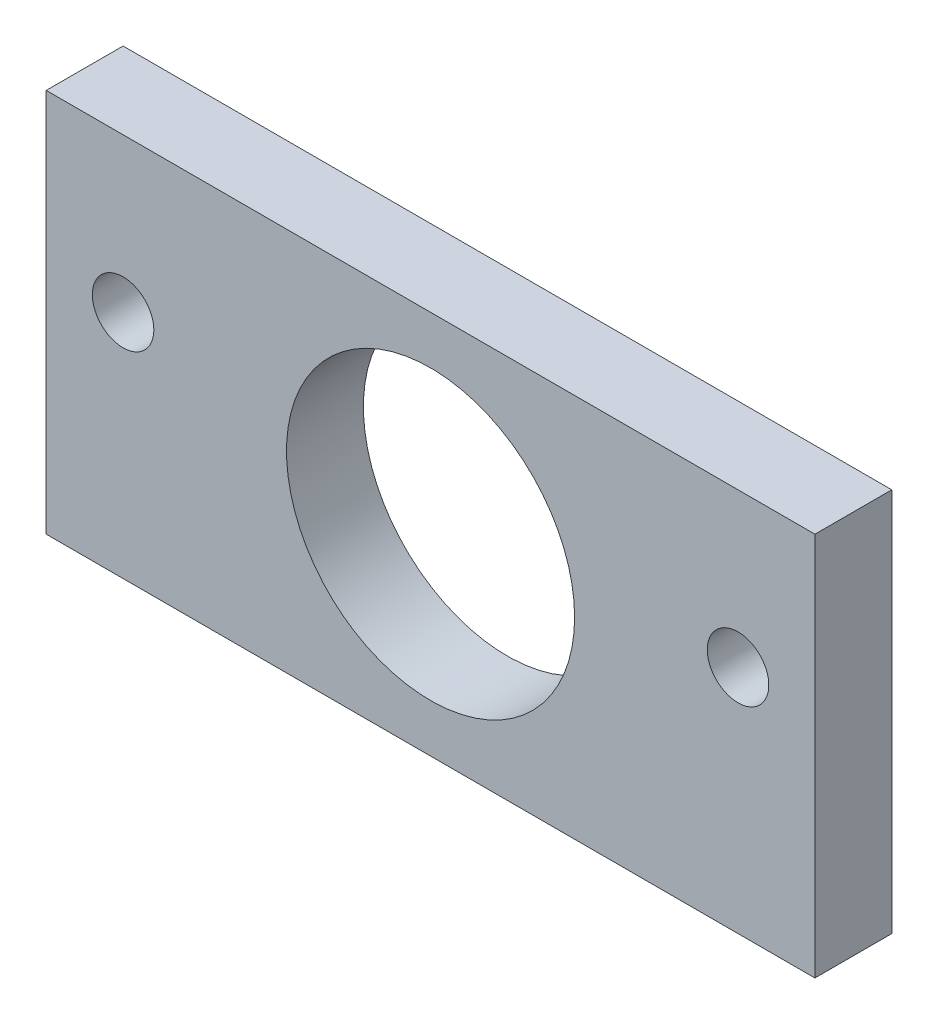
ISO-10303-21;
HEADER;
FILE_DESCRIPTION(('STEP AP214'),'2;1');
FILE_NAME('part.step','',(''),(''),'','','');
FILE_SCHEMA(('AUTOMOTIVE_DESIGN { 1 0 10303 214 1 1 1 1 }'));
ENDSEC;
DATA;
#1=APPLICATION_CONTEXT('core data for automotive mechanical design processes');
#2=APPLICATION_PROTOCOL_DEFINITION('international standard','automotive_design',2000,#1);
#3=PRODUCT_CONTEXT('',#1,'mechanical');
#4=PRODUCT('Part','Part','',(#3));
#5=PRODUCT_RELATED_PRODUCT_CATEGORY('part','',(#4));
#6=PRODUCT_DEFINITION_FORMATION('','',#4);
#7=PRODUCT_DEFINITION_CONTEXT('part definition',#1,'design');
#8=PRODUCT_DEFINITION('design','',#6,#7);
#9=PRODUCT_DEFINITION_SHAPE('','',#8);
#10=(LENGTH_UNIT() NAMED_UNIT(*) SI_UNIT(.MILLI.,.METRE.));
#11=(NAMED_UNIT(*) PLANE_ANGLE_UNIT() SI_UNIT($,.RADIAN.));
#12=(NAMED_UNIT(*) SI_UNIT($,.STERADIAN.) SOLID_ANGLE_UNIT());
#13=UNCERTAINTY_MEASURE_WITH_UNIT(LENGTH_MEASURE(1.E-05),#10,'distance_accuracy_value','');
#14=(GEOMETRIC_REPRESENTATION_CONTEXT(3) GLOBAL_UNCERTAINTY_ASSIGNED_CONTEXT((#13)) GLOBAL_UNIT_ASSIGNED_CONTEXT((#10,
#11,#12)) REPRESENTATION_CONTEXT('',''));
#15=CARTESIAN_POINT('',(0.,0.,0.));
#16=DIRECTION('',(0.,0.,1.));
#17=DIRECTION('',(1.,0.,0.));
#18=AXIS2_PLACEMENT_3D('',#15,#16,#17);
#19=CARTESIAN_POINT('',(0.,0.,6.35));
#20=DIRECTION('',(0.,0.,-1.));
#21=DIRECTION('',(-1.,0.,0.));
#22=AXIS2_PLACEMENT_3D('',#19,#20,#21);
#23=PLANE('',#22);
#24=CARTESIAN_POINT('',(6.35,19.05,6.35));
#25=DIRECTION('',(0.,0.,1.));
#26=DIRECTION('',(1.,0.,0.));
#27=AXIS2_PLACEMENT_3D('',#24,#25,#26);
#28=CIRCLE('',#27,2.54000000000001);
#29=CARTESIAN_POINT('',(8.89000000000001,19.05,6.35));
#30=VERTEX_POINT('',#29);
#31=EDGE_CURVE('E115',#30,#30,#28,.T.);
#32=ORIENTED_EDGE('',*,*,#31,.F.);
#33=EDGE_LOOP('',(#32));
#34=FACE_BOUND('',#33,.T.);
#35=DIRECTION('',(0.,-1.,0.));
#36=VECTOR('',#35,1.);
#37=CARTESIAN_POINT('',(0.,0.,6.35));
#38=LINE('',#37,#36);
#39=CARTESIAN_POINT('',(0.,31.75,6.35));
#40=VERTEX_POINT('',#39);
#41=CARTESIAN_POINT('',(0.,0.,6.35));
#42=VERTEX_POINT('',#41);
#43=EDGE_CURVE('E85',#40,#42,#38,.T.);
#44=ORIENTED_EDGE('',*,*,#43,.T.);
#45=DIRECTION('',(1.,0.,0.));
#46=VECTOR('',#45,1.);
#47=CARTESIAN_POINT('',(0.,0.,6.35));
#48=LINE('',#47,#46);
#49=CARTESIAN_POINT('',(63.5,0.,6.35));
#50=VERTEX_POINT('',#49);
#51=EDGE_CURVE('E80',#42,#50,#48,.T.);
#52=ORIENTED_EDGE('',*,*,#51,.T.);
#53=DIRECTION('',(0.,1.,0.));
#54=VECTOR('',#53,1.);
#55=CARTESIAN_POINT('',(63.5,0.,6.35));
#56=LINE('',#55,#54);
#57=CARTESIAN_POINT('',(63.5,31.75,6.35));
#58=VERTEX_POINT('',#57);
#59=EDGE_CURVE('E83',#50,#58,#56,.T.);
#60=ORIENTED_EDGE('',*,*,#59,.T.);
#61=DIRECTION('',(-1.,0.,0.));
#62=VECTOR('',#61,1.);
#63=CARTESIAN_POINT('',(0.,31.75,6.35));
#64=LINE('',#63,#62);
#65=EDGE_CURVE('E50',#58,#40,#64,.T.);
#66=ORIENTED_EDGE('',*,*,#65,.T.);
#67=EDGE_LOOP('',(#44,#52,#60,#66));
#68=FACE_BOUND('',#67,.T.);
#69=CARTESIAN_POINT('',(31.75,15.875,6.35));
#70=DIRECTION('',(0.,0.,1.));
#71=DIRECTION('',(1.,0.,0.));
#72=AXIS2_PLACEMENT_3D('',#69,#70,#71);
#73=CIRCLE('',#72,11.8999);
#74=CARTESIAN_POINT('',(43.6499,15.875,6.35));
#75=VERTEX_POINT('',#74);
#76=EDGE_CURVE('E100',#75,#75,#73,.T.);
#77=ORIENTED_EDGE('',*,*,#76,.F.);
#78=EDGE_LOOP('',(#77));
#79=FACE_BOUND('',#78,.T.);
#80=CARTESIAN_POINT('',(57.15,19.05,6.35));
#81=DIRECTION('',(0.,0.,1.));
#82=DIRECTION('',(-1.,0.,0.));
#83=AXIS2_PLACEMENT_3D('',#80,#81,#82);
#84=CIRCLE('',#83,2.54000000000001);
#85=CARTESIAN_POINT('',(54.61,19.05,6.35));
#86=VERTEX_POINT('',#85);
#87=EDGE_CURVE('E121',#86,#86,#84,.T.);
#88=ORIENTED_EDGE('',*,*,#87,.F.);
#89=EDGE_LOOP('',(#88));
#90=FACE_BOUND('',#89,.T.);
#91=ADVANCED_FACE('F33',(#34,#68,#79,#90),#23,.F.);
#92=CARTESIAN_POINT('',(0.,0.,0.));
#93=DIRECTION('',(0.,0.,-1.));
#94=DIRECTION('',(-1.,0.,0.));
#95=AXIS2_PLACEMENT_3D('',#92,#93,#94);
#96=PLANE('',#95);
#97=CARTESIAN_POINT('',(6.35,19.05,0.));
#98=DIRECTION('',(0.,0.,1.));
#99=DIRECTION('',(1.,0.,0.));
#100=AXIS2_PLACEMENT_3D('',#97,#98,#99);
#101=CIRCLE('',#100,2.54000000000001);
#102=CARTESIAN_POINT('',(8.89000000000001,19.05,0.));
#103=VERTEX_POINT('',#102);
#104=EDGE_CURVE('E118',#103,#103,#101,.T.);
#105=ORIENTED_EDGE('',*,*,#104,.T.);
#106=EDGE_LOOP('',(#105));
#107=FACE_BOUND('',#106,.T.);
#108=DIRECTION('',(0.,-1.,0.));
#109=VECTOR('',#108,1.);
#110=CARTESIAN_POINT('',(0.,0.,0.));
#111=LINE('',#110,#109);
#112=CARTESIAN_POINT('',(0.,31.75,0.));
#113=VERTEX_POINT('',#112);
#114=CARTESIAN_POINT('',(0.,0.,0.));
#115=VERTEX_POINT('',#114);
#116=EDGE_CURVE('E97',#113,#115,#111,.T.);
#117=ORIENTED_EDGE('',*,*,#116,.F.);
#118=DIRECTION('',(-1.,0.,0.));
#119=VECTOR('',#118,1.);
#120=CARTESIAN_POINT('',(0.,31.75,0.));
#121=LINE('',#120,#119);
#122=CARTESIAN_POINT('',(63.5,31.75,0.));
#123=VERTEX_POINT('',#122);
#124=EDGE_CURVE('E73',#123,#113,#121,.T.);
#125=ORIENTED_EDGE('',*,*,#124,.F.);
#126=DIRECTION('',(0.,1.,0.));
#127=VECTOR('',#126,1.);
#128=CARTESIAN_POINT('',(63.5,0.,0.));
#129=LINE('',#128,#127);
#130=CARTESIAN_POINT('',(63.5,0.,0.));
#131=VERTEX_POINT('',#130);
#132=EDGE_CURVE('E67',#131,#123,#129,.T.);
#133=ORIENTED_EDGE('',*,*,#132,.F.);
#134=DIRECTION('',(1.,0.,0.));
#135=VECTOR('',#134,1.);
#136=CARTESIAN_POINT('',(0.,0.,0.));
#137=LINE('',#136,#135);
#138=EDGE_CURVE('E89',#115,#131,#137,.T.);
#139=ORIENTED_EDGE('',*,*,#138,.F.);
#140=EDGE_LOOP('',(#117,#125,#133,#139));
#141=FACE_BOUND('',#140,.T.);
#142=CARTESIAN_POINT('',(31.75,15.875,0.));
#143=DIRECTION('',(0.,0.,1.));
#144=DIRECTION('',(1.,0.,0.));
#145=AXIS2_PLACEMENT_3D('',#142,#143,#144);
#146=CIRCLE('',#145,11.8999);
#147=CARTESIAN_POINT('',(43.6499,15.875,0.));
#148=VERTEX_POINT('',#147);
#149=EDGE_CURVE('E112',#148,#148,#146,.T.);
#150=ORIENTED_EDGE('',*,*,#149,.T.);
#151=EDGE_LOOP('',(#150));
#152=FACE_BOUND('',#151,.T.);
#153=CARTESIAN_POINT('',(57.15,19.05,0.));
#154=DIRECTION('',(0.,0.,1.));
#155=DIRECTION('',(-1.,0.,0.));
#156=AXIS2_PLACEMENT_3D('',#153,#154,#155);
#157=CIRCLE('',#156,2.54000000000001);
#158=CARTESIAN_POINT('',(54.61,19.05,0.));
#159=VERTEX_POINT('',#158);
#160=EDGE_CURVE('E124',#159,#159,#157,.T.);
#161=ORIENTED_EDGE('',*,*,#160,.T.);
#162=EDGE_LOOP('',(#161));
#163=FACE_BOUND('',#162,.T.);
#164=ADVANCED_FACE('F108',(#107,#141,#152,#163),#96,.T.);
#165=CARTESIAN_POINT('',(0.,0.,6.35));
#166=DIRECTION('',(1.,0.,0.));
#167=DIRECTION('',(0.,0.,-1.));
#168=AXIS2_PLACEMENT_3D('',#165,#166,#167);
#169=PLANE('',#168);
#170=ORIENTED_EDGE('',*,*,#116,.T.);
#171=DIRECTION('',(0.,0.,-1.));
#172=VECTOR('',#171,1.);
#173=CARTESIAN_POINT('',(0.,0.,6.35));
#174=LINE('',#173,#172);
#175=EDGE_CURVE('E11',#42,#115,#174,.T.);
#176=ORIENTED_EDGE('',*,*,#175,.F.);
#177=ORIENTED_EDGE('',*,*,#43,.F.);
#178=DIRECTION('',(0.,0.,-1.));
#179=VECTOR('',#178,1.);
#180=CARTESIAN_POINT('',(0.,31.75,6.35));
#181=LINE('',#180,#179);
#182=EDGE_CURVE('E93',#40,#113,#181,.T.);
#183=ORIENTED_EDGE('',*,*,#182,.T.);
#184=EDGE_LOOP('',(#170,#176,#177,#183));
#185=FACE_BOUND('',#184,.T.);
#186=ADVANCED_FACE('F35',(#185),#169,.F.);
#187=CARTESIAN_POINT('',(0.,0.,6.35));
#188=DIRECTION('',(0.,1.,0.));
#189=DIRECTION('',(-1.,0.,0.));
#190=AXIS2_PLACEMENT_3D('',#187,#188,#189);
#191=PLANE('',#190);
#192=ORIENTED_EDGE('',*,*,#138,.T.);
#193=DIRECTION('',(0.,0.,-1.));
#194=VECTOR('',#193,1.);
#195=CARTESIAN_POINT('',(63.5,0.,6.35));
#196=LINE('',#195,#194);
#197=EDGE_CURVE('E42',#50,#131,#196,.T.);
#198=ORIENTED_EDGE('',*,*,#197,.F.);
#199=ORIENTED_EDGE('',*,*,#51,.F.);
#200=ORIENTED_EDGE('',*,*,#175,.T.);
#201=EDGE_LOOP('',(#192,#198,#199,#200));
#202=FACE_BOUND('',#201,.T.);
#203=ADVANCED_FACE('F88',(#202),#191,.F.);
#204=CARTESIAN_POINT('',(63.5,0.,6.35));
#205=DIRECTION('',(-1.,0.,0.));
#206=DIRECTION('',(0.,0.,1.));
#207=AXIS2_PLACEMENT_3D('',#204,#205,#206);
#208=PLANE('',#207);
#209=ORIENTED_EDGE('',*,*,#132,.T.);
#210=DIRECTION('',(0.,0.,-1.));
#211=VECTOR('',#210,1.);
#212=CARTESIAN_POINT('',(63.5,31.75,6.35));
#213=LINE('',#212,#211);
#214=EDGE_CURVE('E90',#58,#123,#213,.T.);
#215=ORIENTED_EDGE('',*,*,#214,.F.);
#216=ORIENTED_EDGE('',*,*,#59,.F.);
#217=ORIENTED_EDGE('',*,*,#197,.T.);
#218=EDGE_LOOP('',(#209,#215,#216,#217));
#219=FACE_BOUND('',#218,.T.);
#220=ADVANCED_FACE('F91',(#219),#208,.F.);
#221=CARTESIAN_POINT('',(0.,31.75,6.35));
#222=DIRECTION('',(0.,-1.,0.));
#223=DIRECTION('',(1.,0.,0.));
#224=AXIS2_PLACEMENT_3D('',#221,#222,#223);
#225=PLANE('',#224);
#226=ORIENTED_EDGE('',*,*,#124,.T.);
#227=ORIENTED_EDGE('',*,*,#182,.F.);
#228=ORIENTED_EDGE('',*,*,#65,.F.);
#229=ORIENTED_EDGE('',*,*,#214,.T.);
#230=EDGE_LOOP('',(#226,#227,#228,#229));
#231=FACE_BOUND('',#230,.T.);
#232=ADVANCED_FACE('F105',(#231),#225,.F.);
#233=CARTESIAN_POINT('',(31.75,15.875,6.35));
#234=DIRECTION('',(0.,0.,-1.));
#235=DIRECTION('',(-1.,0.,0.));
#236=AXIS2_PLACEMENT_3D('',#233,#234,#235);
#237=CYLINDRICAL_SURFACE('',#236,11.8999);
#238=ORIENTED_EDGE('',*,*,#76,.T.);
#239=EDGE_LOOP('',(#238));
#240=FACE_BOUND('',#239,.T.);
#241=ORIENTED_EDGE('',*,*,#149,.F.);
#242=EDGE_LOOP('',(#241));
#243=FACE_BOUND('',#242,.T.);
#244=ADVANCED_FACE('F143',(#240,#243),#237,.F.);
#245=CARTESIAN_POINT('',(6.35,19.05,6.35));
#246=DIRECTION('',(0.,0.,-1.));
#247=DIRECTION('',(-1.,0.,0.));
#248=AXIS2_PLACEMENT_3D('',#245,#246,#247);
#249=CYLINDRICAL_SURFACE('',#248,2.54000000000001);
#250=ORIENTED_EDGE('',*,*,#31,.T.);
#251=EDGE_LOOP('',(#250));
#252=FACE_BOUND('',#251,.T.);
#253=ORIENTED_EDGE('',*,*,#104,.F.);
#254=EDGE_LOOP('',(#253));
#255=FACE_BOUND('',#254,.T.);
#256=ADVANCED_FACE('F189',(#252,#255),#249,.F.);
#257=CARTESIAN_POINT('',(57.15,19.05,6.35));
#258=DIRECTION('',(0.,0.,-1.));
#259=DIRECTION('',(-1.,0.,0.));
#260=AXIS2_PLACEMENT_3D('',#257,#258,#259);
#261=CYLINDRICAL_SURFACE('',#260,2.54000000000001);
#262=ORIENTED_EDGE('',*,*,#87,.T.);
#263=EDGE_LOOP('',(#262));
#264=FACE_BOUND('',#263,.T.);
#265=ORIENTED_EDGE('',*,*,#160,.F.);
#266=EDGE_LOOP('',(#265));
#267=FACE_BOUND('',#266,.T.);
#268=ADVANCED_FACE('F130',(#264,#267),#261,.F.);
#269=CLOSED_SHELL('',(#91,#164,#186,#203,#220,#232,#244,#256,#268));
#270=MANIFOLD_SOLID_BREP('B2',#269);
#271=ADVANCED_BREP_SHAPE_REPRESENTATION('',(#18,#270),#14);
#272=SHAPE_DEFINITION_REPRESENTATION(#9,#271);
ENDSEC;
END-ISO-10303-21;
